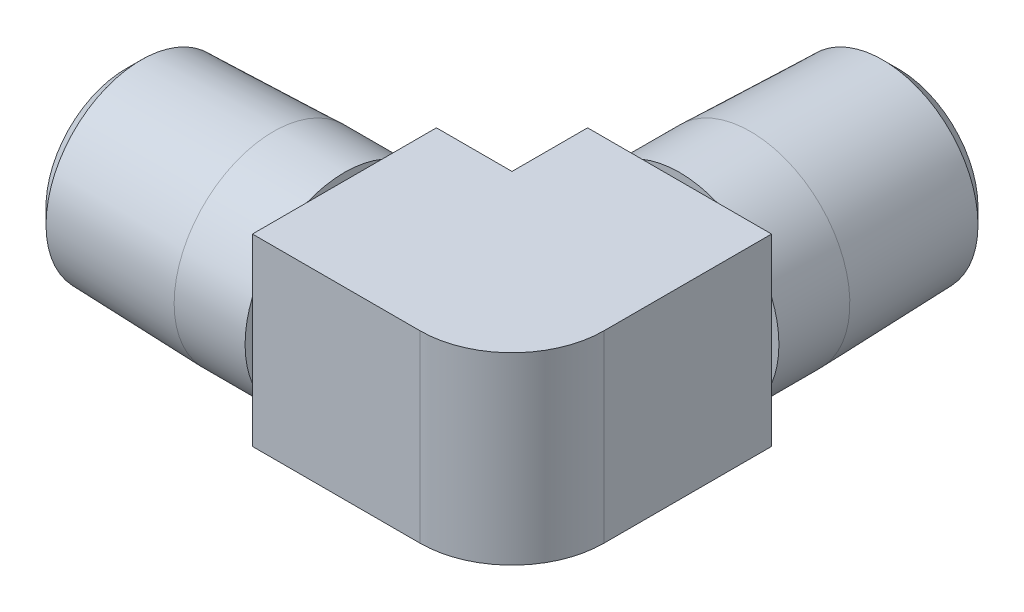
ISO-10303-21;
HEADER;
FILE_DESCRIPTION(('STEP AP214'),'2;1');
FILE_NAME('part.step','',(''),(''),'','','');
FILE_SCHEMA(('AUTOMOTIVE_DESIGN { 1 0 10303 214 1 1 1 1 }'));
ENDSEC;
DATA;
#1=APPLICATION_CONTEXT('core data for automotive mechanical design processes');
#2=APPLICATION_PROTOCOL_DEFINITION('international standard','automotive_design',2000,#1);
#3=PRODUCT_CONTEXT('',#1,'mechanical');
#4=PRODUCT('Part','Part','',(#3));
#5=PRODUCT_RELATED_PRODUCT_CATEGORY('part','',(#4));
#6=PRODUCT_DEFINITION_FORMATION('','',#4);
#7=PRODUCT_DEFINITION_CONTEXT('part definition',#1,'design');
#8=PRODUCT_DEFINITION('design','',#6,#7);
#9=PRODUCT_DEFINITION_SHAPE('','',#8);
#10=(LENGTH_UNIT() NAMED_UNIT(*) SI_UNIT(.MILLI.,.METRE.));
#11=(NAMED_UNIT(*) PLANE_ANGLE_UNIT() SI_UNIT($,.RADIAN.));
#12=(NAMED_UNIT(*) SI_UNIT($,.STERADIAN.) SOLID_ANGLE_UNIT());
#13=UNCERTAINTY_MEASURE_WITH_UNIT(LENGTH_MEASURE(1.E-05),#10,'distance_accuracy_value','');
#14=(GEOMETRIC_REPRESENTATION_CONTEXT(3) GLOBAL_UNCERTAINTY_ASSIGNED_CONTEXT((#13)) GLOBAL_UNIT_ASSIGNED_CONTEXT((#10,
#11,#12)) REPRESENTATION_CONTEXT('',''));
#15=CARTESIAN_POINT('',(0.,0.,0.));
#16=DIRECTION('',(0.,0.,1.));
#17=DIRECTION('',(1.,0.,0.));
#18=AXIS2_PLACEMENT_3D('',#15,#16,#17);
#19=CARTESIAN_POINT('',(20.32,6.35,0.));
#20=DIRECTION('',(-1.,0.,0.));
#21=DIRECTION('',(0.,0.,1.));
#22=AXIS2_PLACEMENT_3D('',#19,#20,#21);
#23=PLANE('',#22);
#24=DIRECTION('',(0.,1.,0.));
#25=VECTOR('',#24,1.);
#26=CARTESIAN_POINT('',(20.32,0.,-11.56716));
#27=LINE('',#26,#25);
#28=CARTESIAN_POINT('',(20.32,-6.35,-11.56716));
#29=VERTEX_POINT('',#28);
#30=CARTESIAN_POINT('',(20.32,-2.59030191290513,-11.56716));
#31=VERTEX_POINT('',#30);
#32=EDGE_CURVE('E149',#29,#31,#27,.T.);
#33=ORIENTED_EDGE('',*,*,#32,.F.);
#34=DIRECTION('',(0.,0.,1.));
#35=VECTOR('',#34,1.);
#36=CARTESIAN_POINT('',(20.32,-6.35,-6.35));
#37=LINE('',#36,#35);
#38=CARTESIAN_POINT('',(20.32,-6.35,-6.35));
#39=VERTEX_POINT('',#38);
#40=EDGE_CURVE('E181',#39,#29,#37,.F.);
#41=ORIENTED_EDGE('',*,*,#40,.F.);
#42=DIRECTION('',(0.,1.,0.));
#43=VECTOR('',#42,1.);
#44=CARTESIAN_POINT('',(20.32,6.35,-6.35));
#45=LINE('',#44,#43);
#46=CARTESIAN_POINT('',(20.32,6.35,-6.35));
#47=VERTEX_POINT('',#46);
#48=EDGE_CURVE('E128',#47,#39,#45,.F.);
#49=ORIENTED_EDGE('',*,*,#48,.F.);
#50=DIRECTION('',(0.,0.,1.));
#51=VECTOR('',#50,1.);
#52=CARTESIAN_POINT('',(20.32,6.35,6.35));
#53=LINE('',#52,#51);
#54=CARTESIAN_POINT('',(20.32,6.35,-11.56716));
#55=VERTEX_POINT('',#54);
#56=EDGE_CURVE('E129',#55,#47,#53,.T.);
#57=ORIENTED_EDGE('',*,*,#56,.F.);
#58=DIRECTION('',(0.,1.,0.));
#59=VECTOR('',#58,1.);
#60=CARTESIAN_POINT('',(20.32,0.,-11.56716));
#61=LINE('',#60,#59);
#62=CARTESIAN_POINT('',(20.32,2.59030191290513,-11.56716));
#63=VERTEX_POINT('',#62);
#64=EDGE_CURVE('E163',#63,#55,#61,.T.);
#65=ORIENTED_EDGE('',*,*,#64,.F.);
#66=DIRECTION('',(0.,1.,0.));
#67=VECTOR('',#66,1.);
#68=CARTESIAN_POINT('',(20.32,0.,-11.56716));
#69=LINE('',#68,#67);
#70=EDGE_CURVE('E145',#31,#63,#69,.T.);
#71=ORIENTED_EDGE('',*,*,#70,.F.);
#72=EDGE_LOOP('',(#33,#41,#49,#57,#65,#71));
#73=FACE_BOUND('',#72,.T.);
#74=ADVANCED_FACE('F16',(#73),#23,.T.);
#75=CARTESIAN_POINT('',(33.02,-6.35,0.));
#76=DIRECTION('',(1.,0.,0.));
#77=DIRECTION('',(0.,0.,-1.));
#78=AXIS2_PLACEMENT_3D('',#75,#76,#77);
#79=PLANE('',#78);
#80=DIRECTION('',(0.,-1.,0.));
#81=VECTOR('',#80,1.);
#82=CARTESIAN_POINT('',(33.02,0.,0.));
#83=LINE('',#82,#81);
#84=CARTESIAN_POINT('',(33.02,-6.35,0.));
#85=VERTEX_POINT('',#84);
#86=CARTESIAN_POINT('',(33.02,6.35,0.));
#87=VERTEX_POINT('',#86);
#88=EDGE_CURVE('E124',#85,#87,#83,.F.);
#89=ORIENTED_EDGE('',*,*,#88,.F.);
#90=DIRECTION('',(0.,0.,1.));
#91=VECTOR('',#90,1.);
#92=CARTESIAN_POINT('',(33.02,-6.35,-6.35));
#93=LINE('',#92,#91);
#94=CARTESIAN_POINT('',(33.02,-6.35,-11.56716));
#95=VERTEX_POINT('',#94);
#96=EDGE_CURVE('E174',#95,#85,#93,.T.);
#97=ORIENTED_EDGE('',*,*,#96,.F.);
#98=DIRECTION('',(0.,1.,0.));
#99=VECTOR('',#98,1.);
#100=CARTESIAN_POINT('',(33.02,0.,-11.56716));
#101=LINE('',#100,#99);
#102=CARTESIAN_POINT('',(33.02,-2.59030191290514,-11.56716));
#103=VERTEX_POINT('',#102);
#104=EDGE_CURVE('E151',#103,#95,#101,.F.);
#105=ORIENTED_EDGE('',*,*,#104,.F.);
#106=DIRECTION('',(0.,1.,0.));
#107=VECTOR('',#106,1.);
#108=CARTESIAN_POINT('',(33.02,0.,-11.56716));
#109=LINE('',#108,#107);
#110=CARTESIAN_POINT('',(33.02,2.59030191290514,-11.56716));
#111=VERTEX_POINT('',#110);
#112=EDGE_CURVE('E156',#111,#103,#109,.F.);
#113=ORIENTED_EDGE('',*,*,#112,.F.);
#114=DIRECTION('',(0.,1.,0.));
#115=VECTOR('',#114,1.);
#116=CARTESIAN_POINT('',(33.02,0.,-11.56716));
#117=LINE('',#116,#115);
#118=CARTESIAN_POINT('',(33.02,6.35,-11.56716));
#119=VERTEX_POINT('',#118);
#120=EDGE_CURVE('E160',#119,#111,#117,.F.);
#121=ORIENTED_EDGE('',*,*,#120,.F.);
#122=DIRECTION('',(0.,0.,1.));
#123=VECTOR('',#122,1.);
#124=CARTESIAN_POINT('',(33.02,6.35,6.35));
#125=LINE('',#124,#123);
#126=EDGE_CURVE('E148',#87,#119,#125,.F.);
#127=ORIENTED_EDGE('',*,*,#126,.F.);
#128=EDGE_LOOP('',(#89,#97,#105,#113,#121,#127));
#129=FACE_BOUND('',#128,.T.);
#130=ADVANCED_FACE('F288',(#129),#79,.T.);
#131=CARTESIAN_POINT('',(26.67,0.,0.));
#132=DIRECTION('',(0.,-1.,0.));
#133=DIRECTION('',(0.,0.,-1.));
#134=AXIS2_PLACEMENT_3D('',#131,#132,#133);
#135=CYLINDRICAL_SURFACE('',#134,6.35);
#136=ORIENTED_EDGE('',*,*,#88,.T.);
#137=CARTESIAN_POINT('',(26.67,6.35,0.));
#138=DIRECTION('',(0.,-1.,0.));
#139=DIRECTION('',(0.,0.,-1.));
#140=AXIS2_PLACEMENT_3D('',#137,#138,#139);
#141=CIRCLE('',#140,6.35);
#142=CARTESIAN_POINT('',(26.67,6.35,6.35));
#143=VERTEX_POINT('',#142);
#144=EDGE_CURVE('E19',#143,#87,#141,.F.);
#145=ORIENTED_EDGE('',*,*,#144,.F.);
#146=DIRECTION('',(0.,1.,0.));
#147=VECTOR('',#146,1.);
#148=CARTESIAN_POINT('',(26.67,-6.35,6.35));
#149=LINE('',#148,#147);
#150=CARTESIAN_POINT('',(26.67,-6.35,6.35));
#151=VERTEX_POINT('',#150);
#152=EDGE_CURVE('E107',#151,#143,#149,.T.);
#153=ORIENTED_EDGE('',*,*,#152,.F.);
#154=CARTESIAN_POINT('',(26.67,-6.35,0.));
#155=DIRECTION('',(0.,-1.,0.));
#156=DIRECTION('',(0.,0.,-1.));
#157=AXIS2_PLACEMENT_3D('',#154,#155,#156);
#158=CIRCLE('',#157,6.35);
#159=EDGE_CURVE('E266',#85,#151,#158,.T.);
#160=ORIENTED_EDGE('',*,*,#159,.F.);
#161=EDGE_LOOP('',(#136,#145,#153,#160));
#162=FACE_BOUND('',#161,.T.);
#163=ADVANCED_FACE('F122',(#162),#135,.T.);
#164=CARTESIAN_POINT('',(29.845,0.,-11.56716));
#165=DIRECTION('',(0.,0.,-1.));
#166=DIRECTION('',(-1.,0.,0.));
#167=AXIS2_PLACEMENT_3D('',#164,#165,#166);
#168=PLANE('',#167);
#169=ORIENTED_EDGE('',*,*,#64,.T.);
#170=DIRECTION('',(-1.,0.,0.));
#171=VECTOR('',#170,1.);
#172=CARTESIAN_POINT('',(15.10284,6.35,-11.56716));
#173=LINE('',#172,#171);
#174=CARTESIAN_POINT('',(24.0796980870949,6.35,-11.56716));
#175=VERTEX_POINT('',#174);
#176=EDGE_CURVE('E196',#175,#55,#173,.T.);
#177=ORIENTED_EDGE('',*,*,#176,.F.);
#178=CARTESIAN_POINT('',(26.67,0.,-11.56716));
#179=DIRECTION('',(0.,0.,1.));
#180=DIRECTION('',(1.,0.,0.));
#181=AXIS2_PLACEMENT_3D('',#178,#179,#180);
#182=CIRCLE('',#181,6.858);
#183=EDGE_CURVE('E134',#63,#175,#182,.F.);
#184=ORIENTED_EDGE('',*,*,#183,.F.);
#185=EDGE_LOOP('',(#169,#177,#184));
#186=FACE_BOUND('',#185,.T.);
#187=ADVANCED_FACE('F504',(#186),#168,.T.);
#188=CARTESIAN_POINT('',(23.241,0.,-11.56716));
#189=DIRECTION('',(0.,0.,1.));
#190=DIRECTION('',(1.,0.,0.));
#191=AXIS2_PLACEMENT_3D('',#188,#189,#190);
#192=PLANE('',#191);
#193=DIRECTION('',(-1.,0.,0.));
#194=VECTOR('',#193,1.);
#195=CARTESIAN_POINT('',(15.10284,6.35,-11.56716));
#196=LINE('',#195,#194);
#197=CARTESIAN_POINT('',(29.2603019129051,6.35,-11.56716));
#198=VERTEX_POINT('',#197);
#199=EDGE_CURVE('E201',#198,#175,#196,.T.);
#200=ORIENTED_EDGE('',*,*,#199,.F.);
#201=CARTESIAN_POINT('',(26.67,0.,-11.56716));
#202=DIRECTION('',(0.,0.,1.));
#203=DIRECTION('',(1.,0.,0.));
#204=AXIS2_PLACEMENT_3D('',#201,#202,#203);
#205=CIRCLE('',#204,6.858);
#206=EDGE_CURVE('E137',#175,#198,#205,.F.);
#207=ORIENTED_EDGE('',*,*,#206,.F.);
#208=EDGE_LOOP('',(#200,#207));
#209=FACE_BOUND('',#208,.T.);
#210=ADVANCED_FACE('F299',(#209),#192,.T.);
#211=CARTESIAN_POINT('',(29.845,0.,-11.56716));
#212=DIRECTION('',(0.,0.,-1.));
#213=DIRECTION('',(-1.,0.,0.));
#214=AXIS2_PLACEMENT_3D('',#211,#212,#213);
#215=PLANE('',#214);
#216=DIRECTION('',(-1.,0.,0.));
#217=VECTOR('',#216,1.);
#218=CARTESIAN_POINT('',(15.10284,6.35,-11.56716));
#219=LINE('',#218,#217);
#220=EDGE_CURVE('E205',#119,#198,#219,.T.);
#221=ORIENTED_EDGE('',*,*,#220,.F.);
#222=ORIENTED_EDGE('',*,*,#120,.T.);
#223=CARTESIAN_POINT('',(26.67,0.,-11.56716));
#224=DIRECTION('',(0.,0.,1.));
#225=DIRECTION('',(1.,0.,0.));
#226=AXIS2_PLACEMENT_3D('',#223,#224,#225);
#227=CIRCLE('',#226,6.858);
#228=EDGE_CURVE('E262',#198,#111,#227,.F.);
#229=ORIENTED_EDGE('',*,*,#228,.F.);
#230=EDGE_LOOP('',(#221,#222,#229));
#231=FACE_BOUND('',#230,.T.);
#232=ADVANCED_FACE('F291',(#231),#215,.T.);
#233=CARTESIAN_POINT('',(23.241,0.,-11.56716));
#234=DIRECTION('',(0.,0.,1.));
#235=DIRECTION('',(1.,0.,0.));
#236=AXIS2_PLACEMENT_3D('',#233,#234,#235);
#237=PLANE('',#236);
#238=CARTESIAN_POINT('',(26.67,0.,-11.56716));
#239=DIRECTION('',(0.,0.,1.));
#240=DIRECTION('',(1.,0.,0.));
#241=AXIS2_PLACEMENT_3D('',#238,#239,#240);
#242=CIRCLE('',#241,6.858);
#243=EDGE_CURVE('E259',#111,#103,#242,.F.);
#244=ORIENTED_EDGE('',*,*,#243,.F.);
#245=ORIENTED_EDGE('',*,*,#112,.T.);
#246=EDGE_LOOP('',(#244,#245));
#247=FACE_BOUND('',#246,.T.);
#248=ADVANCED_FACE('F491',(#247),#237,.T.);
#249=CARTESIAN_POINT('',(29.845,0.,-11.56716));
#250=DIRECTION('',(0.,0.,-1.));
#251=DIRECTION('',(-1.,0.,0.));
#252=AXIS2_PLACEMENT_3D('',#249,#250,#251);
#253=PLANE('',#252);
#254=ORIENTED_EDGE('',*,*,#104,.T.);
#255=DIRECTION('',(1.,0.,0.));
#256=VECTOR('',#255,1.);
#257=CARTESIAN_POINT('',(15.10284,-6.35,-11.56716));
#258=LINE('',#257,#256);
#259=CARTESIAN_POINT('',(29.2603019129051,-6.35,-11.56716));
#260=VERTEX_POINT('',#259);
#261=EDGE_CURVE('E171',#260,#95,#258,.T.);
#262=ORIENTED_EDGE('',*,*,#261,.F.);
#263=CARTESIAN_POINT('',(26.67,0.,-11.56716));
#264=DIRECTION('',(0.,0.,1.));
#265=DIRECTION('',(1.,0.,0.));
#266=AXIS2_PLACEMENT_3D('',#263,#264,#265);
#267=CIRCLE('',#266,6.858);
#268=EDGE_CURVE('E256',#103,#260,#267,.F.);
#269=ORIENTED_EDGE('',*,*,#268,.F.);
#270=EDGE_LOOP('',(#254,#262,#269));
#271=FACE_BOUND('',#270,.T.);
#272=ADVANCED_FACE('F483',(#271),#253,.T.);
#273=CARTESIAN_POINT('',(23.241,0.,-11.56716));
#274=DIRECTION('',(0.,0.,1.));
#275=DIRECTION('',(1.,0.,0.));
#276=AXIS2_PLACEMENT_3D('',#273,#274,#275);
#277=PLANE('',#276);
#278=DIRECTION('',(1.,0.,0.));
#279=VECTOR('',#278,1.);
#280=CARTESIAN_POINT('',(15.10284,-6.35,-11.56716));
#281=LINE('',#280,#279);
#282=CARTESIAN_POINT('',(24.0796980870949,-6.35,-11.56716));
#283=VERTEX_POINT('',#282);
#284=EDGE_CURVE('E175',#283,#260,#281,.T.);
#285=ORIENTED_EDGE('',*,*,#284,.F.);
#286=CARTESIAN_POINT('',(26.67,0.,-11.56716));
#287=DIRECTION('',(0.,0.,1.));
#288=DIRECTION('',(1.,0.,0.));
#289=AXIS2_PLACEMENT_3D('',#286,#287,#288);
#290=CIRCLE('',#289,6.858);
#291=EDGE_CURVE('E253',#260,#283,#290,.F.);
#292=ORIENTED_EDGE('',*,*,#291,.F.);
#293=EDGE_LOOP('',(#285,#292));
#294=FACE_BOUND('',#293,.T.);
#295=ADVANCED_FACE('F489',(#294),#277,.T.);
#296=CARTESIAN_POINT('',(29.845,0.,-11.56716));
#297=DIRECTION('',(0.,0.,-1.));
#298=DIRECTION('',(-1.,0.,0.));
#299=AXIS2_PLACEMENT_3D('',#296,#297,#298);
#300=PLANE('',#299);
#301=DIRECTION('',(1.,0.,0.));
#302=VECTOR('',#301,1.);
#303=CARTESIAN_POINT('',(15.10284,-6.35,-11.56716));
#304=LINE('',#303,#302);
#305=EDGE_CURVE('E179',#29,#283,#304,.T.);
#306=ORIENTED_EDGE('',*,*,#305,.F.);
#307=ORIENTED_EDGE('',*,*,#32,.T.);
#308=CARTESIAN_POINT('',(26.67,0.,-11.56716));
#309=DIRECTION('',(0.,0.,1.));
#310=DIRECTION('',(1.,0.,0.));
#311=AXIS2_PLACEMENT_3D('',#308,#309,#310);
#312=CIRCLE('',#311,6.858);
#313=EDGE_CURVE('E250',#283,#31,#312,.F.);
#314=ORIENTED_EDGE('',*,*,#313,.F.);
#315=EDGE_LOOP('',(#306,#307,#314));
#316=FACE_BOUND('',#315,.T.);
#317=ADVANCED_FACE('F604',(#316),#300,.T.);
#318=CARTESIAN_POINT('',(23.241,0.,-11.56716));
#319=DIRECTION('',(0.,0.,1.));
#320=DIRECTION('',(1.,0.,0.));
#321=AXIS2_PLACEMENT_3D('',#318,#319,#320);
#322=PLANE('',#321);
#323=ORIENTED_EDGE('',*,*,#70,.T.);
#324=CARTESIAN_POINT('',(26.67,0.,-11.56716));
#325=DIRECTION('',(0.,0.,1.));
#326=DIRECTION('',(1.,0.,0.));
#327=AXIS2_PLACEMENT_3D('',#324,#325,#326);
#328=CIRCLE('',#327,6.858);
#329=EDGE_CURVE('E247',#31,#63,#328,.F.);
#330=ORIENTED_EDGE('',*,*,#329,.F.);
#331=EDGE_LOOP('',(#323,#330));
#332=FACE_BOUND('',#331,.T.);
#333=ADVANCED_FACE('F614',(#332),#322,.T.);
#334=CARTESIAN_POINT('',(15.10284,6.35,6.35));
#335=DIRECTION('',(0.,1.,0.));
#336=DIRECTION('',(-1.,0.,0.));
#337=AXIS2_PLACEMENT_3D('',#334,#335,#336);
#338=PLANE('',#337);
#339=DIRECTION('',(1.,0.,0.));
#340=VECTOR('',#339,1.);
#341=CARTESIAN_POINT('',(15.10284,6.35,6.35));
#342=LINE('',#341,#340);
#343=CARTESIAN_POINT('',(15.10284,6.35,6.35));
#344=VERTEX_POINT('',#343);
#345=EDGE_CURVE('E112',#143,#344,#342,.F.);
#346=ORIENTED_EDGE('',*,*,#345,.F.);
#347=ORIENTED_EDGE('',*,*,#144,.T.);
#348=ORIENTED_EDGE('',*,*,#126,.T.);
#349=ORIENTED_EDGE('',*,*,#220,.T.);
#350=ORIENTED_EDGE('',*,*,#199,.T.);
#351=ORIENTED_EDGE('',*,*,#176,.T.);
#352=ORIENTED_EDGE('',*,*,#56,.T.);
#353=DIRECTION('',(-1.,0.,0.));
#354=VECTOR('',#353,1.);
#355=CARTESIAN_POINT('',(15.10284,6.35,-6.35));
#356=LINE('',#355,#354);
#357=CARTESIAN_POINT('',(15.10284,6.35,-6.35));
#358=VERTEX_POINT('',#357);
#359=EDGE_CURVE('E191',#358,#47,#356,.F.);
#360=ORIENTED_EDGE('',*,*,#359,.F.);
#361=DIRECTION('',(0.,0.,1.));
#362=VECTOR('',#361,1.);
#363=CARTESIAN_POINT('',(15.10284,6.35,-3.175));
#364=LINE('',#363,#362);
#365=CARTESIAN_POINT('',(15.10284,6.35,-2.59030191290514));
#366=VERTEX_POINT('',#365);
#367=EDGE_CURVE('E347',#366,#358,#364,.F.);
#368=ORIENTED_EDGE('',*,*,#367,.F.);
#369=DIRECTION('',(0.,0.,-1.));
#370=VECTOR('',#369,1.);
#371=CARTESIAN_POINT('',(15.10284,6.35,3.429));
#372=LINE('',#371,#370);
#373=CARTESIAN_POINT('',(15.10284,6.35,2.59030191290514));
#374=VERTEX_POINT('',#373);
#375=EDGE_CURVE('E352',#374,#366,#372,.T.);
#376=ORIENTED_EDGE('',*,*,#375,.F.);
#377=DIRECTION('',(0.,0.,1.));
#378=VECTOR('',#377,1.);
#379=CARTESIAN_POINT('',(15.10284,6.35,-3.175));
#380=LINE('',#379,#378);
#381=EDGE_CURVE('E133',#344,#374,#380,.F.);
#382=ORIENTED_EDGE('',*,*,#381,.F.);
#383=EDGE_LOOP('',(#346,#347,#348,#349,#350,#351,#352,#360,#368,#376,#382));
#384=FACE_BOUND('',#383,.T.);
#385=ADVANCED_FACE('F131',(#384),#338,.T.);
#386=CARTESIAN_POINT('',(15.10284,6.35,-6.35));
#387=DIRECTION('',(0.,0.,-1.));
#388=DIRECTION('',(-1.,0.,0.));
#389=AXIS2_PLACEMENT_3D('',#386,#387,#388);
#390=PLANE('',#389);
#391=DIRECTION('',(0.,1.,0.));
#392=VECTOR('',#391,1.);
#393=CARTESIAN_POINT('',(15.10284,0.,-6.35));
#394=LINE('',#393,#392);
#395=CARTESIAN_POINT('',(15.10284,2.59030191290514,-6.35));
#396=VERTEX_POINT('',#395);
#397=EDGE_CURVE('E344',#358,#396,#394,.F.);
#398=ORIENTED_EDGE('',*,*,#397,.F.);
#399=ORIENTED_EDGE('',*,*,#359,.T.);
#400=ORIENTED_EDGE('',*,*,#48,.T.);
#401=DIRECTION('',(1.,0.,0.));
#402=VECTOR('',#401,1.);
#403=CARTESIAN_POINT('',(15.10284,-6.35,-6.35));
#404=LINE('',#403,#402);
#405=CARTESIAN_POINT('',(15.10284,-6.35,-6.35));
#406=VERTEX_POINT('',#405);
#407=EDGE_CURVE('E186',#406,#39,#404,.T.);
#408=ORIENTED_EDGE('',*,*,#407,.F.);
#409=DIRECTION('',(0.,1.,0.));
#410=VECTOR('',#409,1.);
#411=CARTESIAN_POINT('',(15.10284,0.,-6.35));
#412=LINE('',#411,#410);
#413=CARTESIAN_POINT('',(15.10284,-2.59030191290514,-6.35));
#414=VERTEX_POINT('',#413);
#415=EDGE_CURVE('E331',#414,#406,#412,.F.);
#416=ORIENTED_EDGE('',*,*,#415,.F.);
#417=DIRECTION('',(0.,1.,0.));
#418=VECTOR('',#417,1.);
#419=CARTESIAN_POINT('',(15.10284,0.,-6.35));
#420=LINE('',#419,#418);
#421=EDGE_CURVE('E335',#396,#414,#420,.F.);
#422=ORIENTED_EDGE('',*,*,#421,.F.);
#423=EDGE_LOOP('',(#398,#399,#400,#408,#416,#422));
#424=FACE_BOUND('',#423,.T.);
#425=ADVANCED_FACE('F315',(#424),#390,.T.);
#426=CARTESIAN_POINT('',(15.10284,-6.35,-6.35));
#427=DIRECTION('',(0.,-1.,0.));
#428=DIRECTION('',(1.,0.,0.));
#429=AXIS2_PLACEMENT_3D('',#426,#427,#428);
#430=PLANE('',#429);
#431=ORIENTED_EDGE('',*,*,#96,.T.);
#432=ORIENTED_EDGE('',*,*,#159,.T.);
#433=DIRECTION('',(1.,0.,0.));
#434=VECTOR('',#433,1.);
#435=CARTESIAN_POINT('',(15.10284,-6.35,6.35));
#436=LINE('',#435,#434);
#437=CARTESIAN_POINT('',(15.10284,-6.35,6.35));
#438=VERTEX_POINT('',#437);
#439=EDGE_CURVE('E116',#438,#151,#436,.T.);
#440=ORIENTED_EDGE('',*,*,#439,.F.);
#441=DIRECTION('',(0.,0.,1.));
#442=VECTOR('',#441,1.);
#443=CARTESIAN_POINT('',(15.10284,-6.35,-3.175));
#444=LINE('',#443,#442);
#445=CARTESIAN_POINT('',(15.10284,-6.35,2.59030191290514));
#446=VERTEX_POINT('',#445);
#447=EDGE_CURVE('E333',#446,#438,#444,.T.);
#448=ORIENTED_EDGE('',*,*,#447,.F.);
#449=DIRECTION('',(0.,0.,-1.));
#450=VECTOR('',#449,1.);
#451=CARTESIAN_POINT('',(15.10284,-6.35,3.429));
#452=LINE('',#451,#450);
#453=CARTESIAN_POINT('',(15.10284,-6.35,-2.59030191290514));
#454=VERTEX_POINT('',#453);
#455=EDGE_CURVE('E324',#454,#446,#452,.F.);
#456=ORIENTED_EDGE('',*,*,#455,.F.);
#457=DIRECTION('',(0.,0.,1.));
#458=VECTOR('',#457,1.);
#459=CARTESIAN_POINT('',(15.10284,-6.35,-3.175));
#460=LINE('',#459,#458);
#461=EDGE_CURVE('E322',#406,#454,#460,.T.);
#462=ORIENTED_EDGE('',*,*,#461,.F.);
#463=ORIENTED_EDGE('',*,*,#407,.T.);
#464=ORIENTED_EDGE('',*,*,#40,.T.);
#465=ORIENTED_EDGE('',*,*,#305,.T.);
#466=ORIENTED_EDGE('',*,*,#284,.T.);
#467=ORIENTED_EDGE('',*,*,#261,.T.);
#468=EDGE_LOOP('',(#431,#432,#440,#448,#456,#462,#463,#464,#465,#466,#467));
#469=FACE_BOUND('',#468,.T.);
#470=ADVANCED_FACE('F320',(#469),#430,.T.);
#471=CARTESIAN_POINT('',(15.10284,-6.35,6.35));
#472=DIRECTION('',(0.,0.,1.));
#473=DIRECTION('',(1.,0.,0.));
#474=AXIS2_PLACEMENT_3D('',#471,#472,#473);
#475=PLANE('',#474);
#476=ORIENTED_EDGE('',*,*,#152,.T.);
#477=ORIENTED_EDGE('',*,*,#345,.T.);
#478=DIRECTION('',(0.,1.,0.));
#479=VECTOR('',#478,1.);
#480=CARTESIAN_POINT('',(15.10284,0.,6.35));
#481=LINE('',#480,#479);
#482=CARTESIAN_POINT('',(15.10284,2.59030191290514,6.35));
#483=VERTEX_POINT('',#482);
#484=EDGE_CURVE('E249',#483,#344,#481,.T.);
#485=ORIENTED_EDGE('',*,*,#484,.F.);
#486=DIRECTION('',(0.,1.,0.));
#487=VECTOR('',#486,1.);
#488=CARTESIAN_POINT('',(15.10284,0.,6.35));
#489=LINE('',#488,#487);
#490=CARTESIAN_POINT('',(15.10284,-2.59030191290514,6.35));
#491=VERTEX_POINT('',#490);
#492=EDGE_CURVE('E363',#491,#483,#489,.T.);
#493=ORIENTED_EDGE('',*,*,#492,.F.);
#494=DIRECTION('',(0.,1.,0.));
#495=VECTOR('',#494,1.);
#496=CARTESIAN_POINT('',(15.10284,0.,6.35));
#497=LINE('',#496,#495);
#498=EDGE_CURVE('E367',#438,#491,#497,.T.);
#499=ORIENTED_EDGE('',*,*,#498,.F.);
#500=ORIENTED_EDGE('',*,*,#439,.T.);
#501=EDGE_LOOP('',(#476,#477,#485,#493,#499,#500));
#502=FACE_BOUND('',#501,.T.);
#503=ADVANCED_FACE('F109',(#502),#475,.T.);
#504=CARTESIAN_POINT('',(26.67,0.,-14.01572));
#505=DIRECTION('',(0.,0.,1.));
#506=DIRECTION('',(1.,0.,0.));
#507=AXIS2_PLACEMENT_3D('',#504,#505,#506);
#508=CYLINDRICAL_SURFACE('',#507,6.858);
#509=CARTESIAN_POINT('',(26.67,0.,-16.4642799999797));
#510=DIRECTION('',(0.,0.,1.));
#511=DIRECTION('',(-1.,0.,0.));
#512=AXIS2_PLACEMENT_3D('',#509,#510,#511);
#513=CIRCLE('',#512,6.85800000000006);
#514=CARTESIAN_POINT('',(19.8119999999999,0.,-16.4642799999797));
#515=VERTEX_POINT('',#514);
#516=EDGE_CURVE('E246',#515,#515,#513,.F.);
#517=ORIENTED_EDGE('',*,*,#516,.F.);
#518=EDGE_LOOP('',(#517));
#519=FACE_BOUND('',#518,.T.);
#520=ORIENTED_EDGE('',*,*,#313,.T.);
#521=ORIENTED_EDGE('',*,*,#329,.T.);
#522=ORIENTED_EDGE('',*,*,#183,.T.);
#523=ORIENTED_EDGE('',*,*,#206,.T.);
#524=ORIENTED_EDGE('',*,*,#228,.T.);
#525=ORIENTED_EDGE('',*,*,#243,.T.);
#526=ORIENTED_EDGE('',*,*,#268,.T.);
#527=ORIENTED_EDGE('',*,*,#291,.T.);
#528=EDGE_LOOP('',(#520,#521,#522,#523,#524,#525,#526,#527));
#529=FACE_BOUND('',#528,.T.);
#530=ADVANCED_FACE('F295',(#519,#529),#508,.T.);
#531=CARTESIAN_POINT('',(15.10284,0.,-3.175));
#532=DIRECTION('',(-1.,0.,0.));
#533=DIRECTION('',(0.,0.,1.));
#534=AXIS2_PLACEMENT_3D('',#531,#532,#533);
#535=PLANE('',#534);
#536=ORIENTED_EDGE('',*,*,#484,.T.);
#537=ORIENTED_EDGE('',*,*,#381,.T.);
#538=CARTESIAN_POINT('',(15.10284,0.,0.));
#539=DIRECTION('',(1.,0.,0.));
#540=DIRECTION('',(0.,0.,-1.));
#541=AXIS2_PLACEMENT_3D('',#538,#539,#540);
#542=CIRCLE('',#541,6.858);
#543=EDGE_CURVE('E243',#483,#374,#542,.F.);
#544=ORIENTED_EDGE('',*,*,#543,.F.);
#545=EDGE_LOOP('',(#536,#537,#544));
#546=FACE_BOUND('',#545,.T.);
#547=ADVANCED_FACE('F676',(#546),#535,.T.);
#548=CARTESIAN_POINT('',(15.10284,0.,3.429));
#549=DIRECTION('',(1.,0.,0.));
#550=DIRECTION('',(0.,0.,-1.));
#551=AXIS2_PLACEMENT_3D('',#548,#549,#550);
#552=PLANE('',#551);
#553=ORIENTED_EDGE('',*,*,#375,.T.);
#554=CARTESIAN_POINT('',(15.10284,0.,0.));
#555=DIRECTION('',(1.,0.,0.));
#556=DIRECTION('',(0.,0.,-1.));
#557=AXIS2_PLACEMENT_3D('',#554,#555,#556);
#558=CIRCLE('',#557,6.858);
#559=EDGE_CURVE('E240',#374,#366,#558,.F.);
#560=ORIENTED_EDGE('',*,*,#559,.F.);
#561=EDGE_LOOP('',(#553,#560));
#562=FACE_BOUND('',#561,.T.);
#563=ADVANCED_FACE('F688',(#562),#552,.T.);
#564=CARTESIAN_POINT('',(15.10284,0.,-3.175));
#565=DIRECTION('',(-1.,0.,0.));
#566=DIRECTION('',(0.,0.,1.));
#567=AXIS2_PLACEMENT_3D('',#564,#565,#566);
#568=PLANE('',#567);
#569=ORIENTED_EDGE('',*,*,#367,.T.);
#570=ORIENTED_EDGE('',*,*,#397,.T.);
#571=CARTESIAN_POINT('',(15.10284,0.,0.));
#572=DIRECTION('',(1.,0.,0.));
#573=DIRECTION('',(0.,0.,-1.));
#574=AXIS2_PLACEMENT_3D('',#571,#572,#573);
#575=CIRCLE('',#574,6.858);
#576=EDGE_CURVE('E237',#366,#396,#575,.F.);
#577=ORIENTED_EDGE('',*,*,#576,.F.);
#578=EDGE_LOOP('',(#569,#570,#577));
#579=FACE_BOUND('',#578,.T.);
#580=ADVANCED_FACE('F700',(#579),#568,.T.);
#581=CARTESIAN_POINT('',(15.10284,0.,3.429));
#582=DIRECTION('',(1.,0.,0.));
#583=DIRECTION('',(0.,0.,-1.));
#584=AXIS2_PLACEMENT_3D('',#581,#582,#583);
#585=PLANE('',#584);
#586=CARTESIAN_POINT('',(15.10284,0.,0.));
#587=DIRECTION('',(1.,0.,0.));
#588=DIRECTION('',(0.,0.,-1.));
#589=AXIS2_PLACEMENT_3D('',#586,#587,#588);
#590=CIRCLE('',#589,6.858);
#591=EDGE_CURVE('E234',#396,#414,#590,.F.);
#592=ORIENTED_EDGE('',*,*,#591,.F.);
#593=ORIENTED_EDGE('',*,*,#421,.T.);
#594=EDGE_LOOP('',(#592,#593));
#595=FACE_BOUND('',#594,.T.);
#596=ADVANCED_FACE('F399',(#595),#585,.T.);
#597=CARTESIAN_POINT('',(15.10284,0.,-3.175));
#598=DIRECTION('',(-1.,0.,0.));
#599=DIRECTION('',(0.,0.,1.));
#600=AXIS2_PLACEMENT_3D('',#597,#598,#599);
#601=PLANE('',#600);
#602=ORIENTED_EDGE('',*,*,#415,.T.);
#603=ORIENTED_EDGE('',*,*,#461,.T.);
#604=CARTESIAN_POINT('',(15.10284,0.,0.));
#605=DIRECTION('',(1.,0.,0.));
#606=DIRECTION('',(0.,0.,-1.));
#607=AXIS2_PLACEMENT_3D('',#604,#605,#606);
#608=CIRCLE('',#607,6.858);
#609=EDGE_CURVE('E231',#414,#454,#608,.F.);
#610=ORIENTED_EDGE('',*,*,#609,.F.);
#611=EDGE_LOOP('',(#602,#603,#610));
#612=FACE_BOUND('',#611,.T.);
#613=ADVANCED_FACE('F391',(#612),#601,.T.);
#614=CARTESIAN_POINT('',(15.10284,0.,3.429));
#615=DIRECTION('',(1.,0.,0.));
#616=DIRECTION('',(0.,0.,-1.));
#617=AXIS2_PLACEMENT_3D('',#614,#615,#616);
#618=PLANE('',#617);
#619=ORIENTED_EDGE('',*,*,#455,.T.);
#620=CARTESIAN_POINT('',(15.10284,0.,0.));
#621=DIRECTION('',(1.,0.,0.));
#622=DIRECTION('',(0.,0.,-1.));
#623=AXIS2_PLACEMENT_3D('',#620,#621,#622);
#624=CIRCLE('',#623,6.858);
#625=EDGE_CURVE('E228',#454,#446,#624,.F.);
#626=ORIENTED_EDGE('',*,*,#625,.F.);
#627=EDGE_LOOP('',(#619,#626));
#628=FACE_BOUND('',#627,.T.);
#629=ADVANCED_FACE('F389',(#628),#618,.T.);
#630=CARTESIAN_POINT('',(15.10284,0.,-3.175));
#631=DIRECTION('',(-1.,0.,0.));
#632=DIRECTION('',(0.,0.,1.));
#633=AXIS2_PLACEMENT_3D('',#630,#631,#632);
#634=PLANE('',#633);
#635=ORIENTED_EDGE('',*,*,#447,.T.);
#636=ORIENTED_EDGE('',*,*,#498,.T.);
#637=CARTESIAN_POINT('',(15.10284,0.,0.));
#638=DIRECTION('',(1.,0.,0.));
#639=DIRECTION('',(0.,0.,-1.));
#640=AXIS2_PLACEMENT_3D('',#637,#638,#639);
#641=CIRCLE('',#640,6.858);
#642=EDGE_CURVE('E225',#446,#491,#641,.F.);
#643=ORIENTED_EDGE('',*,*,#642,.F.);
#644=EDGE_LOOP('',(#635,#636,#643));
#645=FACE_BOUND('',#644,.T.);
#646=ADVANCED_FACE('F382',(#645),#634,.T.);
#647=CARTESIAN_POINT('',(15.10284,0.,3.429));
#648=DIRECTION('',(1.,0.,0.));
#649=DIRECTION('',(0.,0.,-1.));
#650=AXIS2_PLACEMENT_3D('',#647,#648,#649);
#651=PLANE('',#650);
#652=ORIENTED_EDGE('',*,*,#492,.T.);
#653=CARTESIAN_POINT('',(15.10284,0.,0.));
#654=DIRECTION('',(1.,0.,0.));
#655=DIRECTION('',(0.,0.,-1.));
#656=AXIS2_PLACEMENT_3D('',#653,#654,#655);
#657=CIRCLE('',#656,6.858);
#658=EDGE_CURVE('E222',#491,#483,#657,.F.);
#659=ORIENTED_EDGE('',*,*,#658,.F.);
#660=EDGE_LOOP('',(#652,#659));
#661=FACE_BOUND('',#660,.T.);
#662=ADVANCED_FACE('F385',(#661),#651,.T.);
#663=CARTESIAN_POINT('',(26.67,0.,-16.4642800001502));
#664=DIRECTION('',(0.,0.,1.));
#665=DIRECTION('',(1.,0.,0.));
#666=AXIS2_PLACEMENT_3D('',#663,#664,#665);
#667=CONICAL_SURFACE('',#666,6.85799999999473,0.0311250383216209);
#668=CARTESIAN_POINT('',(26.67,0.,-25.5940874043858));
#669=DIRECTION('',(0.,0.,1.));
#670=DIRECTION('',(-1.,0.,0.));
#671=AXIS2_PLACEMENT_3D('',#668,#669,#670);
#672=CIRCLE('',#671,6.57374259558166);
#673=CARTESIAN_POINT('',(20.0962574044183,0.,-25.5940874043858));
#674=VERTEX_POINT('',#673);
#675=EDGE_CURVE('E224',#674,#674,#672,.F.);
#676=ORIENTED_EDGE('',*,*,#675,.F.);
#677=EDGE_LOOP('',(#676));
#678=FACE_BOUND('',#677,.T.);
#679=ORIENTED_EDGE('',*,*,#516,.T.);
#680=EDGE_LOOP('',(#679));
#681=FACE_BOUND('',#680,.T.);
#682=ADVANCED_FACE('F443',(#678,#681),#667,.T.);
#683=CARTESIAN_POINT('',(12.65428,0.,0.));
#684=DIRECTION('',(1.,0.,0.));
#685=DIRECTION('',(0.,0.,-1.));
#686=AXIS2_PLACEMENT_3D('',#683,#684,#685);
#687=CYLINDRICAL_SURFACE('',#686,6.858);
#688=CARTESIAN_POINT('',(10.2057199999877,0.,0.));
#689=DIRECTION('',(1.,0.,0.));
#690=DIRECTION('',(0.,0.,1.));
#691=AXIS2_PLACEMENT_3D('',#688,#689,#690);
#692=CIRCLE('',#691,6.85799999999759);
#693=CARTESIAN_POINT('',(10.2057199999877,0.,6.85799999999759));
#694=VERTEX_POINT('',#693);
#695=EDGE_CURVE('E221',#694,#694,#692,.F.);
#696=ORIENTED_EDGE('',*,*,#695,.F.);
#697=EDGE_LOOP('',(#696));
#698=FACE_BOUND('',#697,.T.);
#699=ORIENTED_EDGE('',*,*,#642,.T.);
#700=ORIENTED_EDGE('',*,*,#658,.T.);
#701=ORIENTED_EDGE('',*,*,#543,.T.);
#702=ORIENTED_EDGE('',*,*,#559,.T.);
#703=ORIENTED_EDGE('',*,*,#576,.T.);
#704=ORIENTED_EDGE('',*,*,#591,.T.);
#705=ORIENTED_EDGE('',*,*,#609,.T.);
#706=ORIENTED_EDGE('',*,*,#625,.T.);
#707=EDGE_LOOP('',(#699,#700,#701,#702,#703,#704,#705,#706));
#708=FACE_BOUND('',#707,.T.);
#709=ADVANCED_FACE('F387',(#698,#708),#687,.T.);
#710=CARTESIAN_POINT('',(26.67,0.,-25.5940874044427));
#711=DIRECTION('',(0.,0.,1.));
#712=DIRECTION('',(1.,0.,0.));
#713=AXIS2_PLACEMENT_3D('',#710,#711,#712);
#714=CONICAL_SURFACE('',#713,6.57374259552482,0.785398163371032);
#715=CARTESIAN_POINT('',(26.67,0.,-26.6700000000242));
#716=DIRECTION('',(0.,0.,1.));
#717=DIRECTION('',(1.,0.,0.));
#718=AXIS2_PLACEMENT_3D('',#715,#716,#717);
#719=CIRCLE('',#718,5.49783000000018);
#720=CARTESIAN_POINT('',(32.1678300000002,0.,-26.6700000000242));
#721=VERTEX_POINT('',#720);
#722=EDGE_CURVE('E217',#721,#721,#719,.F.);
#723=ORIENTED_EDGE('',*,*,#722,.F.);
#724=EDGE_LOOP('',(#723));
#725=FACE_BOUND('',#724,.T.);
#726=ORIENTED_EDGE('',*,*,#675,.T.);
#727=EDGE_LOOP('',(#726));
#728=FACE_BOUND('',#727,.T.);
#729=ADVANCED_FACE('F441',(#725,#728),#714,.T.);
#730=CARTESIAN_POINT('',(10.2057199999877,0.,0.));
#731=DIRECTION('',(1.,0.,0.));
#732=DIRECTION('',(0.,0.,-1.));
#733=AXIS2_PLACEMENT_3D('',#730,#731,#732);
#734=CONICAL_SURFACE('',#733,6.85799999999759,0.0311250383214254);
#735=CARTESIAN_POINT('',(1.07591259563833,0.,0.));
#736=DIRECTION('',(1.,0.,0.));
#737=DIRECTION('',(0.,0.,1.));
#738=AXIS2_PLACEMENT_3D('',#735,#736,#737);
#739=CIRCLE('',#738,6.573742595549);
#740=CARTESIAN_POINT('',(1.07591259563833,0.,6.57374259554899));
#741=VERTEX_POINT('',#740);
#742=EDGE_CURVE('E220',#741,#741,#739,.F.);
#743=ORIENTED_EDGE('',*,*,#742,.F.);
#744=EDGE_LOOP('',(#743));
#745=FACE_BOUND('',#744,.T.);
#746=ORIENTED_EDGE('',*,*,#695,.T.);
#747=EDGE_LOOP('',(#746));
#748=FACE_BOUND('',#747,.T.);
#749=ADVANCED_FACE('F456',(#745,#748),#734,.T.);
#750=CARTESIAN_POINT('',(23.3998780216776,0.,-26.67));
#751=DIRECTION('',(0.,0.,-1.));
#752=DIRECTION('',(-1.,0.,0.));
#753=AXIS2_PLACEMENT_3D('',#750,#751,#752);
#754=PLANE('',#753);
#755=ORIENTED_EDGE('',*,*,#722,.T.);
#756=EDGE_LOOP('',(#755));
#757=FACE_BOUND('',#756,.T.);
#758=CARTESIAN_POINT('',(26.67,0.,-26.67));
#759=DIRECTION('',(0.,0.,-1.));
#760=DIRECTION('',(-1.,0.,0.));
#761=AXIS2_PLACEMENT_3D('',#758,#759,#760);
#762=CIRCLE('',#761,3.556);
#763=CARTESIAN_POINT('',(23.114,0.,-26.67));
#764=VERTEX_POINT('',#763);
#765=EDGE_CURVE('E214',#764,#764,#762,.F.);
#766=ORIENTED_EDGE('',*,*,#765,.T.);
#767=EDGE_LOOP('',(#766));
#768=FACE_BOUND('',#767,.T.);
#769=ADVANCED_FACE('F459',(#757,#768),#754,.T.);
#770=CARTESIAN_POINT('',(1.07591259575202,0.,0.));
#771=DIRECTION('',(1.,0.,0.));
#772=DIRECTION('',(0.,0.,-1.));
#773=AXIS2_PLACEMENT_3D('',#770,#771,#772);
#774=CONICAL_SURFACE('',#773,6.57374259571953,0.785398163397448);
#775=CARTESIAN_POINT('',(0.,0.,0.));
#776=DIRECTION('',(1.,0.,0.));
#777=DIRECTION('',(0.,0.,-1.));
#778=AXIS2_PLACEMENT_3D('',#775,#776,#777);
#779=CIRCLE('',#778,5.49782999996751);
#780=CARTESIAN_POINT('',(0.,0.,-5.49782999996752));
#781=VERTEX_POINT('',#780);
#782=EDGE_CURVE('E211',#781,#781,#779,.F.);
#783=ORIENTED_EDGE('',*,*,#782,.F.);
#784=EDGE_LOOP('',(#783));
#785=FACE_BOUND('',#784,.T.);
#786=ORIENTED_EDGE('',*,*,#742,.T.);
#787=EDGE_LOOP('',(#786));
#788=FACE_BOUND('',#787,.T.);
#789=ADVANCED_FACE('F422',(#785,#788),#774,.T.);
#790=CARTESIAN_POINT('',(26.67,0.,0.));
#791=DIRECTION('',(1.,0.,0.));
#792=DIRECTION('',(0.,1.,0.));
#793=AXIS2_PLACEMENT_3D('',#790,#791,#792);
#794=SPHERICAL_SURFACE('',#793,3.556);
#795=CARTESIAN_POINT('',(26.67,0.,0.));
#796=DIRECTION('',(-1.,0.,0.));
#797=DIRECTION('',(0.,0.,1.));
#798=AXIS2_PLACEMENT_3D('',#795,#796,#797);
#799=CIRCLE('',#798,3.556);
#800=CARTESIAN_POINT('',(26.67,-3.556,0.));
#801=VERTEX_POINT('',#800);
#802=CARTESIAN_POINT('',(26.67,3.556,0.));
#803=VERTEX_POINT('',#802);
#804=EDGE_CURVE('E210',#801,#803,#799,.T.);
#805=ORIENTED_EDGE('',*,*,#804,.T.);
#806=CARTESIAN_POINT('',(26.67,0.,0.));
#807=DIRECTION('',(0.,0.,-1.));
#808=DIRECTION('',(-1.,0.,0.));
#809=AXIS2_PLACEMENT_3D('',#806,#807,#808);
#810=CIRCLE('',#809,3.556);
#811=CARTESIAN_POINT('',(30.226,0.,0.));
#812=VERTEX_POINT('',#811);
#813=EDGE_CURVE('E34',#803,#812,#810,.T.);
#814=ORIENTED_EDGE('',*,*,#813,.T.);
#815=CARTESIAN_POINT('',(26.67,0.,0.));
#816=DIRECTION('',(0.,0.,-1.));
#817=DIRECTION('',(1.,0.,0.));
#818=AXIS2_PLACEMENT_3D('',#815,#816,#817);
#819=CIRCLE('',#818,3.556);
#820=EDGE_CURVE('E430',#801,#812,#819,.F.);
#821=ORIENTED_EDGE('',*,*,#820,.F.);
#822=EDGE_LOOP('',(#805,#814,#821));
#823=FACE_BOUND('',#822,.T.);
#824=ADVANCED_FACE('F417',(#823),#794,.F.);
#825=CARTESIAN_POINT('',(26.67,0.,-19.11858));
#826=DIRECTION('',(0.,0.,-1.));
#827=DIRECTION('',(-1.,0.,0.));
#828=AXIS2_PLACEMENT_3D('',#825,#826,#827);
#829=CYLINDRICAL_SURFACE('',#828,3.556);
#830=ORIENTED_EDGE('',*,*,#765,.F.);
#831=EDGE_LOOP('',(#830));
#832=FACE_BOUND('',#831,.T.);
#833=ORIENTED_EDGE('',*,*,#820,.T.);
#834=ORIENTED_EDGE('',*,*,#813,.F.);
#835=CARTESIAN_POINT('',(26.67,0.,0.));
#836=DIRECTION('',(0.707106781186548,0.,-0.707106781186547));
#837=DIRECTION('',(-0.707106781186547,0.,-0.707106781186548));
#838=AXIS2_PLACEMENT_3D('',#835,#836,#837);
#839=ELLIPSE('',#838,5.02894342779873,3.556);
#840=EDGE_CURVE('E25',#803,#801,#839,.F.);
#841=ORIENTED_EDGE('',*,*,#840,.T.);
#842=EDGE_LOOP('',(#833,#834,#841));
#843=FACE_BOUND('',#842,.T.);
#844=ADVANCED_FACE('F409',(#832,#843),#829,.F.);
#845=CARTESIAN_POINT('',(0.,0.,3.27012197832236));
#846=DIRECTION('',(-1.,0.,0.));
#847=DIRECTION('',(0.,0.,1.));
#848=AXIS2_PLACEMENT_3D('',#845,#846,#847);
#849=PLANE('',#848);
#850=ORIENTED_EDGE('',*,*,#782,.T.);
#851=EDGE_LOOP('',(#850));
#852=FACE_BOUND('',#851,.T.);
#853=CARTESIAN_POINT('',(0.,0.,0.));
#854=DIRECTION('',(-1.,0.,0.));
#855=DIRECTION('',(0.,0.,1.));
#856=AXIS2_PLACEMENT_3D('',#853,#854,#855);
#857=CIRCLE('',#856,3.556);
#858=CARTESIAN_POINT('',(0.,0.,3.556));
#859=VERTEX_POINT('',#858);
#860=EDGE_CURVE('E11',#859,#859,#857,.F.);
#861=ORIENTED_EDGE('',*,*,#860,.T.);
#862=EDGE_LOOP('',(#861));
#863=FACE_BOUND('',#862,.T.);
#864=ADVANCED_FACE('F403',(#852,#863),#849,.T.);
#865=CARTESIAN_POINT('',(7.55142,0.,0.));
#866=DIRECTION('',(-1.,0.,0.));
#867=DIRECTION('',(0.,0.,1.));
#868=AXIS2_PLACEMENT_3D('',#865,#866,#867);
#869=CYLINDRICAL_SURFACE('',#868,3.556);
#870=ORIENTED_EDGE('',*,*,#860,.F.);
#871=EDGE_LOOP('',(#870));
#872=FACE_BOUND('',#871,.T.);
#873=ORIENTED_EDGE('',*,*,#804,.F.);
#874=ORIENTED_EDGE('',*,*,#840,.F.);
#875=EDGE_LOOP('',(#873,#874));
#876=FACE_BOUND('',#875,.T.);
#877=ADVANCED_FACE('F401',(#872,#876),#869,.F.);
#878=CLOSED_SHELL('',(#74,#130,#163,#187,#210,#232,#248,#272,#295,#317,#333,#385,#425,#470,#503,
#530,#547,#563,#580,#596,#613,#629,#646,#662,#682,#709,#729,#749,#769,#789,#824,#844,#864,#877));
#879=MANIFOLD_SOLID_BREP('B1',#878);
#880=ADVANCED_BREP_SHAPE_REPRESENTATION('',(#18,#879),#14);
#881=SHAPE_DEFINITION_REPRESENTATION(#9,#880);
ENDSEC;
END-ISO-10303-21;
